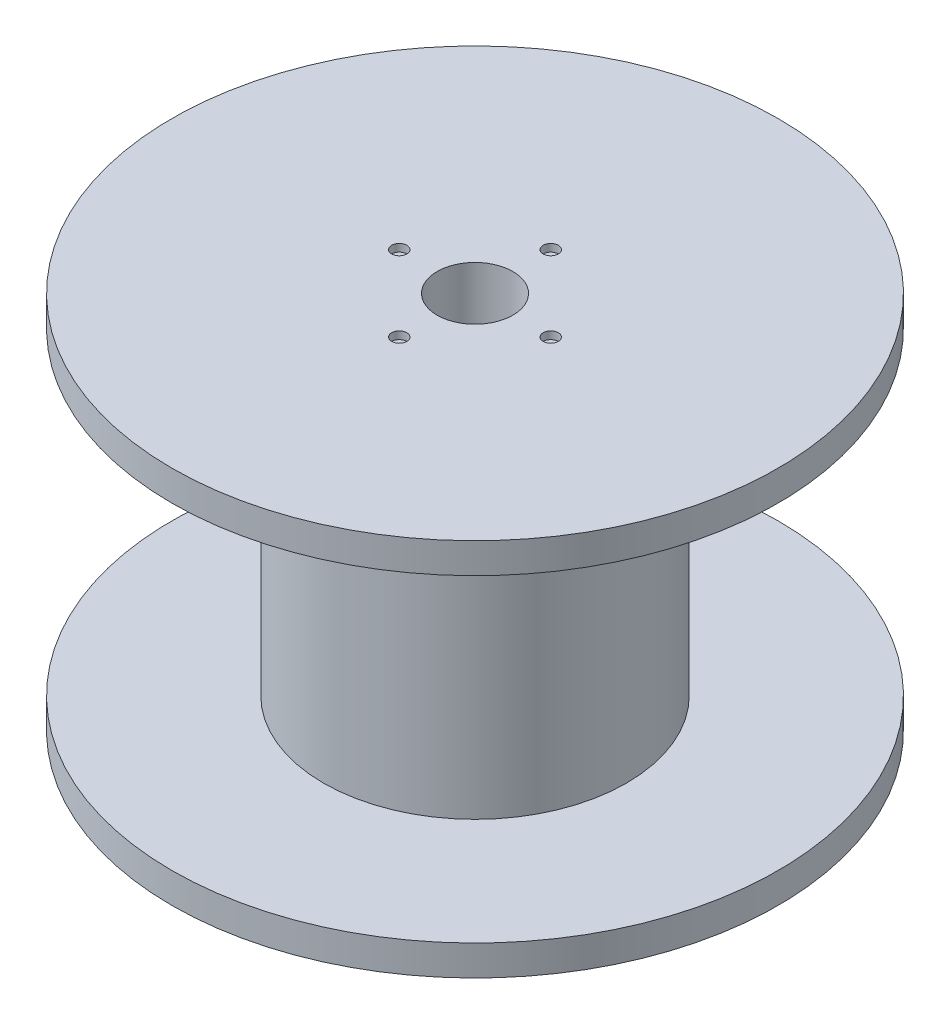
ISO-10303-21;
HEADER;
FILE_DESCRIPTION(('STEP AP214'),'2;1');
FILE_NAME('part.step','',(''),(''),'','','');
FILE_SCHEMA(('AUTOMOTIVE_DESIGN { 1 0 10303 214 1 1 1 1 }'));
ENDSEC;
DATA;
#1=APPLICATION_CONTEXT('core data for automotive mechanical design processes');
#2=APPLICATION_PROTOCOL_DEFINITION('international standard','automotive_design',2000,#1);
#3=PRODUCT_CONTEXT('',#1,'mechanical');
#4=PRODUCT('Part','Part','',(#3));
#5=PRODUCT_RELATED_PRODUCT_CATEGORY('part','',(#4));
#6=PRODUCT_DEFINITION_FORMATION('','',#4);
#7=PRODUCT_DEFINITION_CONTEXT('part definition',#1,'design');
#8=PRODUCT_DEFINITION('design','',#6,#7);
#9=PRODUCT_DEFINITION_SHAPE('','',#8);
#10=(LENGTH_UNIT() NAMED_UNIT(*) SI_UNIT(.MILLI.,.METRE.));
#11=(NAMED_UNIT(*) PLANE_ANGLE_UNIT() SI_UNIT($,.RADIAN.));
#12=(NAMED_UNIT(*) SI_UNIT($,.STERADIAN.) SOLID_ANGLE_UNIT());
#13=UNCERTAINTY_MEASURE_WITH_UNIT(LENGTH_MEASURE(1.E-05),#10,'distance_accuracy_value','');
#14=(GEOMETRIC_REPRESENTATION_CONTEXT(3) GLOBAL_UNCERTAINTY_ASSIGNED_CONTEXT((#13)) GLOBAL_UNIT_ASSIGNED_CONTEXT((#10,
#11,#12)) REPRESENTATION_CONTEXT('',''));
#15=CARTESIAN_POINT('',(0.,0.,0.));
#16=DIRECTION('',(0.,0.,1.));
#17=DIRECTION('',(1.,0.,0.));
#18=AXIS2_PLACEMENT_3D('',#15,#16,#17);
#19=CARTESIAN_POINT('',(0.,0.,0.));
#20=DIRECTION('',(0.,1.,0.));
#21=DIRECTION('',(0.,0.,1.));
#22=AXIS2_PLACEMENT_3D('',#19,#20,#21);
#23=PLANE('',#22);
#24=CARTESIAN_POINT('',(0.,0.,5.));
#25=DIRECTION('',(0.,1.,0.));
#26=DIRECTION('',(0.,0.,1.));
#27=AXIS2_PLACEMENT_3D('',#24,#25,#26);
#28=CIRCLE('',#27,0.5);
#29=CARTESIAN_POINT('',(0.,0.,5.5));
#30=VERTEX_POINT('',#29);
#31=EDGE_CURVE('E98',#30,#30,#28,.T.);
#32=ORIENTED_EDGE('',*,*,#31,.T.);
#33=EDGE_LOOP('',(#32));
#34=FACE_BOUND('',#33,.T.);
#35=CARTESIAN_POINT('',(0.,0.,-5.));
#36=DIRECTION('',(0.,1.,0.));
#37=DIRECTION('',(0.,0.,1.));
#38=AXIS2_PLACEMENT_3D('',#35,#36,#37);
#39=CIRCLE('',#38,0.5);
#40=CARTESIAN_POINT('',(0.,0.,-4.5));
#41=VERTEX_POINT('',#40);
#42=EDGE_CURVE('E86',#41,#41,#39,.T.);
#43=ORIENTED_EDGE('',*,*,#42,.T.);
#44=EDGE_LOOP('',(#43));
#45=FACE_BOUND('',#44,.T.);
#46=CARTESIAN_POINT('',(0.,0.,0.));
#47=DIRECTION('',(0.,1.,0.));
#48=DIRECTION('',(0.,0.,1.));
#49=AXIS2_PLACEMENT_3D('',#46,#47,#48);
#50=CIRCLE('',#49,2.5);
#51=CARTESIAN_POINT('',(0.,0.,2.5));
#52=VERTEX_POINT('',#51);
#53=EDGE_CURVE('E53',#52,#52,#50,.T.);
#54=ORIENTED_EDGE('',*,*,#53,.T.);
#55=EDGE_LOOP('',(#54));
#56=FACE_BOUND('',#55,.T.);
#57=CARTESIAN_POINT('',(0.,0.,0.));
#58=DIRECTION('',(0.,1.,0.));
#59=DIRECTION('',(0.,0.,1.));
#60=AXIS2_PLACEMENT_3D('',#57,#58,#59);
#61=CIRCLE('',#60,20.);
#62=CARTESIAN_POINT('',(0.,0.,20.));
#63=VERTEX_POINT('',#62);
#64=EDGE_CURVE('E49',#63,#63,#61,.T.);
#65=ORIENTED_EDGE('',*,*,#64,.F.);
#66=EDGE_LOOP('',(#65));
#67=FACE_BOUND('',#66,.T.);
#68=CARTESIAN_POINT('',(5.,0.,0.));
#69=DIRECTION('',(0.,1.,0.));
#70=DIRECTION('',(0.,0.,1.));
#71=AXIS2_PLACEMENT_3D('',#68,#69,#70);
#72=CIRCLE('',#71,0.500000000000001);
#73=CARTESIAN_POINT('',(5.,0.,0.500000000000001));
#74=VERTEX_POINT('',#73);
#75=EDGE_CURVE('E92',#74,#74,#72,.T.);
#76=ORIENTED_EDGE('',*,*,#75,.T.);
#77=EDGE_LOOP('',(#76));
#78=FACE_BOUND('',#77,.T.);
#79=CARTESIAN_POINT('',(-5.,0.,0.));
#80=DIRECTION('',(0.,1.,0.));
#81=DIRECTION('',(0.,0.,1.));
#82=AXIS2_PLACEMENT_3D('',#79,#80,#81);
#83=CIRCLE('',#82,0.500000000000001);
#84=CARTESIAN_POINT('',(-5.,0.,0.500000000000001));
#85=VERTEX_POINT('',#84);
#86=EDGE_CURVE('E104',#85,#85,#83,.T.);
#87=ORIENTED_EDGE('',*,*,#86,.T.);
#88=EDGE_LOOP('',(#87));
#89=FACE_BOUND('',#88,.T.);
#90=ADVANCED_FACE('F32',(#34,#45,#56,#67,#78,#89),#23,.F.);
#91=CARTESIAN_POINT('',(0.,25.,0.));
#92=DIRECTION('',(0.,-1.,0.));
#93=DIRECTION('',(0.,0.,-1.));
#94=AXIS2_PLACEMENT_3D('',#91,#92,#93);
#95=CYLINDRICAL_SURFACE('',#94,10.);
#96=CARTESIAN_POINT('',(0.,2.,0.));
#97=DIRECTION('',(0.,1.,0.));
#98=DIRECTION('',(0.,0.,1.));
#99=AXIS2_PLACEMENT_3D('',#96,#97,#98);
#100=CIRCLE('',#99,10.);
#101=CARTESIAN_POINT('',(0.,2.,10.));
#102=VERTEX_POINT('',#101);
#103=EDGE_CURVE('E36',#102,#102,#100,.T.);
#104=ORIENTED_EDGE('',*,*,#103,.T.);
#105=EDGE_LOOP('',(#104));
#106=FACE_BOUND('',#105,.T.);
#107=CARTESIAN_POINT('',(0.,23.,0.));
#108=DIRECTION('',(0.,1.,0.));
#109=DIRECTION('',(0.,0.,1.));
#110=AXIS2_PLACEMENT_3D('',#107,#108,#109);
#111=CIRCLE('',#110,10.);
#112=CARTESIAN_POINT('',(0.,23.,10.));
#113=VERTEX_POINT('',#112);
#114=EDGE_CURVE('E10',#113,#113,#111,.T.);
#115=ORIENTED_EDGE('',*,*,#114,.F.);
#116=EDGE_LOOP('',(#115));
#117=FACE_BOUND('',#116,.T.);
#118=ADVANCED_FACE('F34',(#106,#117),#95,.T.);
#119=CARTESIAN_POINT('',(0.,23.,0.));
#120=DIRECTION('',(0.,1.,0.));
#121=DIRECTION('',(0.,0.,1.));
#122=AXIS2_PLACEMENT_3D('',#119,#120,#121);
#123=PLANE('',#122);
#124=CARTESIAN_POINT('',(0.,23.,0.));
#125=DIRECTION('',(0.,1.,0.));
#126=DIRECTION('',(0.,0.,1.));
#127=AXIS2_PLACEMENT_3D('',#124,#125,#126);
#128=CIRCLE('',#127,20.);
#129=CARTESIAN_POINT('',(0.,23.,20.));
#130=VERTEX_POINT('',#129);
#131=EDGE_CURVE('E40',#130,#130,#128,.T.);
#132=ORIENTED_EDGE('',*,*,#131,.F.);
#133=EDGE_LOOP('',(#132));
#134=FACE_BOUND('',#133,.T.);
#135=ORIENTED_EDGE('',*,*,#114,.T.);
#136=EDGE_LOOP('',(#135));
#137=FACE_BOUND('',#136,.T.);
#138=ADVANCED_FACE('F126',(#134,#137),#123,.F.);
#139=CARTESIAN_POINT('',(0.,23.,0.));
#140=DIRECTION('',(0.,1.,0.));
#141=DIRECTION('',(0.,0.,1.));
#142=AXIS2_PLACEMENT_3D('',#139,#140,#141);
#143=CYLINDRICAL_SURFACE('',#142,20.);
#144=ORIENTED_EDGE('',*,*,#131,.T.);
#145=EDGE_LOOP('',(#144));
#146=FACE_BOUND('',#145,.T.);
#147=CARTESIAN_POINT('',(0.,25.,0.));
#148=DIRECTION('',(0.,1.,0.));
#149=DIRECTION('',(0.,0.,1.));
#150=AXIS2_PLACEMENT_3D('',#147,#148,#149);
#151=CIRCLE('',#150,20.);
#152=CARTESIAN_POINT('',(0.,25.,20.));
#153=VERTEX_POINT('',#152);
#154=EDGE_CURVE('E44',#153,#153,#151,.T.);
#155=ORIENTED_EDGE('',*,*,#154,.F.);
#156=EDGE_LOOP('',(#155));
#157=FACE_BOUND('',#156,.T.);
#158=ADVANCED_FACE('F134',(#146,#157),#143,.T.);
#159=CARTESIAN_POINT('',(0.,25.,0.));
#160=DIRECTION('',(0.,1.,0.));
#161=DIRECTION('',(0.,0.,1.));
#162=AXIS2_PLACEMENT_3D('',#159,#160,#161);
#163=PLANE('',#162);
#164=CARTESIAN_POINT('',(-5.,25.,0.));
#165=DIRECTION('',(0.,1.,0.));
#166=DIRECTION('',(0.,0.,1.));
#167=AXIS2_PLACEMENT_3D('',#164,#165,#166);
#168=CIRCLE('',#167,0.500000000000001);
#169=CARTESIAN_POINT('',(-5.,25.,0.500000000000001));
#170=VERTEX_POINT('',#169);
#171=EDGE_CURVE('E80',#170,#170,#168,.T.);
#172=ORIENTED_EDGE('',*,*,#171,.F.);
#173=EDGE_LOOP('',(#172));
#174=FACE_BOUND('',#173,.T.);
#175=CARTESIAN_POINT('',(0.,25.,5.));
#176=DIRECTION('',(0.,1.,0.));
#177=DIRECTION('',(0.,0.,1.));
#178=AXIS2_PLACEMENT_3D('',#175,#176,#177);
#179=CIRCLE('',#178,0.5);
#180=CARTESIAN_POINT('',(0.,25.,5.5));
#181=VERTEX_POINT('',#180);
#182=EDGE_CURVE('E74',#181,#181,#179,.T.);
#183=ORIENTED_EDGE('',*,*,#182,.F.);
#184=EDGE_LOOP('',(#183));
#185=FACE_BOUND('',#184,.T.);
#186=CARTESIAN_POINT('',(5.,25.,0.));
#187=DIRECTION('',(0.,1.,0.));
#188=DIRECTION('',(0.,0.,1.));
#189=AXIS2_PLACEMENT_3D('',#186,#187,#188);
#190=CIRCLE('',#189,0.500000000000001);
#191=CARTESIAN_POINT('',(5.,25.,0.500000000000001));
#192=VERTEX_POINT('',#191);
#193=EDGE_CURVE('E68',#192,#192,#190,.T.);
#194=ORIENTED_EDGE('',*,*,#193,.F.);
#195=EDGE_LOOP('',(#194));
#196=FACE_BOUND('',#195,.T.);
#197=CARTESIAN_POINT('',(0.,25.,-5.));
#198=DIRECTION('',(0.,1.,0.));
#199=DIRECTION('',(0.,0.,1.));
#200=AXIS2_PLACEMENT_3D('',#197,#198,#199);
#201=CIRCLE('',#200,0.5);
#202=CARTESIAN_POINT('',(0.,25.,-4.5));
#203=VERTEX_POINT('',#202);
#204=EDGE_CURVE('E62',#203,#203,#201,.T.);
#205=ORIENTED_EDGE('',*,*,#204,.F.);
#206=EDGE_LOOP('',(#205));
#207=FACE_BOUND('',#206,.T.);
#208=CARTESIAN_POINT('',(0.,25.,0.));
#209=DIRECTION('',(0.,1.,0.));
#210=DIRECTION('',(0.,0.,1.));
#211=AXIS2_PLACEMENT_3D('',#208,#209,#210);
#212=CIRCLE('',#211,2.5);
#213=CARTESIAN_POINT('',(0.,25.,2.5));
#214=VERTEX_POINT('',#213);
#215=EDGE_CURVE('E56',#214,#214,#212,.T.);
#216=ORIENTED_EDGE('',*,*,#215,.F.);
#217=EDGE_LOOP('',(#216));
#218=FACE_BOUND('',#217,.T.);
#219=ORIENTED_EDGE('',*,*,#154,.T.);
#220=EDGE_LOOP('',(#219));
#221=FACE_BOUND('',#220,.T.);
#222=ADVANCED_FACE('F130',(#174,#185,#196,#207,#218,#221),#163,.T.);
#223=CARTESIAN_POINT('',(0.,2.,0.));
#224=DIRECTION('',(0.,1.,0.));
#225=DIRECTION('',(0.,0.,1.));
#226=AXIS2_PLACEMENT_3D('',#223,#224,#225);
#227=PLANE('',#226);
#228=CARTESIAN_POINT('',(0.,2.,0.));
#229=DIRECTION('',(0.,1.,0.));
#230=DIRECTION('',(0.,0.,1.));
#231=AXIS2_PLACEMENT_3D('',#228,#229,#230);
#232=CIRCLE('',#231,20.);
#233=CARTESIAN_POINT('',(0.,2.,20.));
#234=VERTEX_POINT('',#233);
#235=EDGE_CURVE('E52',#234,#234,#232,.T.);
#236=ORIENTED_EDGE('',*,*,#235,.T.);
#237=EDGE_LOOP('',(#236));
#238=FACE_BOUND('',#237,.T.);
#239=ORIENTED_EDGE('',*,*,#103,.F.);
#240=EDGE_LOOP('',(#239));
#241=FACE_BOUND('',#240,.T.);
#242=ADVANCED_FACE('F133',(#238,#241),#227,.T.);
#243=CARTESIAN_POINT('',(0.,2.,0.));
#244=DIRECTION('',(0.,-1.,0.));
#245=DIRECTION('',(0.,0.,-1.));
#246=AXIS2_PLACEMENT_3D('',#243,#244,#245);
#247=CYLINDRICAL_SURFACE('',#246,20.);
#248=ORIENTED_EDGE('',*,*,#235,.F.);
#249=EDGE_LOOP('',(#248));
#250=FACE_BOUND('',#249,.T.);
#251=ORIENTED_EDGE('',*,*,#64,.T.);
#252=EDGE_LOOP('',(#251));
#253=FACE_BOUND('',#252,.T.);
#254=ADVANCED_FACE('F142',(#250,#253),#247,.T.);
#255=CARTESIAN_POINT('',(0.,0.,0.));
#256=DIRECTION('',(0.,1.,0.));
#257=DIRECTION('',(0.,0.,1.));
#258=AXIS2_PLACEMENT_3D('',#255,#256,#257);
#259=CYLINDRICAL_SURFACE('',#258,2.5);
#260=ORIENTED_EDGE('',*,*,#53,.F.);
#261=EDGE_LOOP('',(#260));
#262=FACE_BOUND('',#261,.T.);
#263=ORIENTED_EDGE('',*,*,#215,.T.);
#264=EDGE_LOOP('',(#263));
#265=FACE_BOUND('',#264,.T.);
#266=ADVANCED_FACE('F145',(#262,#265),#259,.F.);
#267=CARTESIAN_POINT('',(0.,24.5,-5.));
#268=DIRECTION('',(0.,1.,0.));
#269=DIRECTION('',(0.,0.,1.));
#270=AXIS2_PLACEMENT_3D('',#267,#268,#269);
#271=CYLINDRICAL_SURFACE('',#270,0.5);
#272=CARTESIAN_POINT('',(0.,24.5,-5.));
#273=DIRECTION('',(0.,1.,0.));
#274=DIRECTION('',(0.,0.,1.));
#275=AXIS2_PLACEMENT_3D('',#272,#273,#274);
#276=CIRCLE('',#275,0.5);
#277=CARTESIAN_POINT('',(0.,24.5,-4.5));
#278=VERTEX_POINT('',#277);
#279=EDGE_CURVE('E59',#278,#278,#276,.T.);
#280=ORIENTED_EDGE('',*,*,#279,.F.);
#281=EDGE_LOOP('',(#280));
#282=FACE_BOUND('',#281,.T.);
#283=ORIENTED_EDGE('',*,*,#204,.T.);
#284=EDGE_LOOP('',(#283));
#285=FACE_BOUND('',#284,.T.);
#286=ADVANCED_FACE('F152',(#282,#285),#271,.F.);
#287=CARTESIAN_POINT('',(0.,24.5,-5.));
#288=DIRECTION('',(0.,1.,0.));
#289=DIRECTION('',(0.,0.,1.));
#290=AXIS2_PLACEMENT_3D('',#287,#288,#289);
#291=PLANE('',#290);
#292=ORIENTED_EDGE('',*,*,#279,.T.);
#293=EDGE_LOOP('',(#292));
#294=FACE_BOUND('',#293,.T.);
#295=ADVANCED_FACE('F156',(#294),#291,.T.);
#296=CARTESIAN_POINT('',(5.,24.5,0.));
#297=DIRECTION('',(0.,1.,0.));
#298=DIRECTION('',(0.,0.,1.));
#299=AXIS2_PLACEMENT_3D('',#296,#297,#298);
#300=CYLINDRICAL_SURFACE('',#299,0.500000000000001);
#301=CARTESIAN_POINT('',(5.,24.5,0.));
#302=DIRECTION('',(0.,1.,0.));
#303=DIRECTION('',(0.,0.,1.));
#304=AXIS2_PLACEMENT_3D('',#301,#302,#303);
#305=CIRCLE('',#304,0.500000000000001);
#306=CARTESIAN_POINT('',(5.,24.5,0.500000000000001));
#307=VERTEX_POINT('',#306);
#308=EDGE_CURVE('E65',#307,#307,#305,.T.);
#309=ORIENTED_EDGE('',*,*,#308,.F.);
#310=EDGE_LOOP('',(#309));
#311=FACE_BOUND('',#310,.T.);
#312=ORIENTED_EDGE('',*,*,#193,.T.);
#313=EDGE_LOOP('',(#312));
#314=FACE_BOUND('',#313,.T.);
#315=ADVANCED_FACE('F160',(#311,#314),#300,.F.);
#316=CARTESIAN_POINT('',(5.,24.5,0.));
#317=DIRECTION('',(0.,1.,0.));
#318=DIRECTION('',(0.,0.,1.));
#319=AXIS2_PLACEMENT_3D('',#316,#317,#318);
#320=PLANE('',#319);
#321=ORIENTED_EDGE('',*,*,#308,.T.);
#322=EDGE_LOOP('',(#321));
#323=FACE_BOUND('',#322,.T.);
#324=ADVANCED_FACE('F164',(#323),#320,.T.);
#325=CARTESIAN_POINT('',(0.,24.5,5.));
#326=DIRECTION('',(0.,1.,0.));
#327=DIRECTION('',(0.,0.,1.));
#328=AXIS2_PLACEMENT_3D('',#325,#326,#327);
#329=CYLINDRICAL_SURFACE('',#328,0.5);
#330=CARTESIAN_POINT('',(0.,24.5,5.));
#331=DIRECTION('',(0.,1.,0.));
#332=DIRECTION('',(0.,0.,1.));
#333=AXIS2_PLACEMENT_3D('',#330,#331,#332);
#334=CIRCLE('',#333,0.5);
#335=CARTESIAN_POINT('',(0.,24.5,5.5));
#336=VERTEX_POINT('',#335);
#337=EDGE_CURVE('E71',#336,#336,#334,.T.);
#338=ORIENTED_EDGE('',*,*,#337,.F.);
#339=EDGE_LOOP('',(#338));
#340=FACE_BOUND('',#339,.T.);
#341=ORIENTED_EDGE('',*,*,#182,.T.);
#342=EDGE_LOOP('',(#341));
#343=FACE_BOUND('',#342,.T.);
#344=ADVANCED_FACE('F168',(#340,#343),#329,.F.);
#345=CARTESIAN_POINT('',(0.,24.5,5.));
#346=DIRECTION('',(0.,1.,0.));
#347=DIRECTION('',(0.,0.,1.));
#348=AXIS2_PLACEMENT_3D('',#345,#346,#347);
#349=PLANE('',#348);
#350=ORIENTED_EDGE('',*,*,#337,.T.);
#351=EDGE_LOOP('',(#350));
#352=FACE_BOUND('',#351,.T.);
#353=ADVANCED_FACE('F172',(#352),#349,.T.);
#354=CARTESIAN_POINT('',(-5.,24.5,0.));
#355=DIRECTION('',(0.,1.,0.));
#356=DIRECTION('',(0.,0.,1.));
#357=AXIS2_PLACEMENT_3D('',#354,#355,#356);
#358=CYLINDRICAL_SURFACE('',#357,0.500000000000001);
#359=CARTESIAN_POINT('',(-5.,24.5,0.));
#360=DIRECTION('',(0.,1.,0.));
#361=DIRECTION('',(0.,0.,1.));
#362=AXIS2_PLACEMENT_3D('',#359,#360,#361);
#363=CIRCLE('',#362,0.500000000000001);
#364=CARTESIAN_POINT('',(-5.,24.5,0.500000000000001));
#365=VERTEX_POINT('',#364);
#366=EDGE_CURVE('E77',#365,#365,#363,.T.);
#367=ORIENTED_EDGE('',*,*,#366,.F.);
#368=EDGE_LOOP('',(#367));
#369=FACE_BOUND('',#368,.T.);
#370=ORIENTED_EDGE('',*,*,#171,.T.);
#371=EDGE_LOOP('',(#370));
#372=FACE_BOUND('',#371,.T.);
#373=ADVANCED_FACE('F176',(#369,#372),#358,.F.);
#374=CARTESIAN_POINT('',(-5.,24.5,0.));
#375=DIRECTION('',(0.,1.,0.));
#376=DIRECTION('',(0.,0.,1.));
#377=AXIS2_PLACEMENT_3D('',#374,#375,#376);
#378=PLANE('',#377);
#379=ORIENTED_EDGE('',*,*,#366,.T.);
#380=EDGE_LOOP('',(#379));
#381=FACE_BOUND('',#380,.T.);
#382=ADVANCED_FACE('F180',(#381),#378,.T.);
#383=CARTESIAN_POINT('',(0.,0.5,-5.));
#384=DIRECTION('',(0.,-1.,0.));
#385=DIRECTION('',(0.,0.,-1.));
#386=AXIS2_PLACEMENT_3D('',#383,#384,#385);
#387=CYLINDRICAL_SURFACE('',#386,0.5);
#388=CARTESIAN_POINT('',(0.,0.5,-5.));
#389=DIRECTION('',(0.,1.,0.));
#390=DIRECTION('',(0.,0.,1.));
#391=AXIS2_PLACEMENT_3D('',#388,#389,#390);
#392=CIRCLE('',#391,0.5);
#393=CARTESIAN_POINT('',(0.,0.5,-4.5));
#394=VERTEX_POINT('',#393);
#395=EDGE_CURVE('E83',#394,#394,#392,.T.);
#396=ORIENTED_EDGE('',*,*,#395,.T.);
#397=EDGE_LOOP('',(#396));
#398=FACE_BOUND('',#397,.T.);
#399=ORIENTED_EDGE('',*,*,#42,.F.);
#400=EDGE_LOOP('',(#399));
#401=FACE_BOUND('',#400,.T.);
#402=ADVANCED_FACE('F184',(#398,#401),#387,.F.);
#403=CARTESIAN_POINT('',(0.,0.5,-5.));
#404=DIRECTION('',(0.,1.,0.));
#405=DIRECTION('',(0.,0.,1.));
#406=AXIS2_PLACEMENT_3D('',#403,#404,#405);
#407=PLANE('',#406);
#408=ORIENTED_EDGE('',*,*,#395,.F.);
#409=EDGE_LOOP('',(#408));
#410=FACE_BOUND('',#409,.T.);
#411=ADVANCED_FACE('F188',(#410),#407,.F.);
#412=CARTESIAN_POINT('',(5.,0.5,0.));
#413=DIRECTION('',(0.,-1.,0.));
#414=DIRECTION('',(0.,0.,-1.));
#415=AXIS2_PLACEMENT_3D('',#412,#413,#414);
#416=CYLINDRICAL_SURFACE('',#415,0.500000000000001);
#417=CARTESIAN_POINT('',(5.,0.5,0.));
#418=DIRECTION('',(0.,1.,0.));
#419=DIRECTION('',(0.,0.,1.));
#420=AXIS2_PLACEMENT_3D('',#417,#418,#419);
#421=CIRCLE('',#420,0.500000000000001);
#422=CARTESIAN_POINT('',(5.,0.5,0.500000000000001));
#423=VERTEX_POINT('',#422);
#424=EDGE_CURVE('E89',#423,#423,#421,.T.);
#425=ORIENTED_EDGE('',*,*,#424,.T.);
#426=EDGE_LOOP('',(#425));
#427=FACE_BOUND('',#426,.T.);
#428=ORIENTED_EDGE('',*,*,#75,.F.);
#429=EDGE_LOOP('',(#428));
#430=FACE_BOUND('',#429,.T.);
#431=ADVANCED_FACE('F192',(#427,#430),#416,.F.);
#432=CARTESIAN_POINT('',(5.,0.5,0.));
#433=DIRECTION('',(0.,1.,0.));
#434=DIRECTION('',(0.,0.,1.));
#435=AXIS2_PLACEMENT_3D('',#432,#433,#434);
#436=PLANE('',#435);
#437=ORIENTED_EDGE('',*,*,#424,.F.);
#438=EDGE_LOOP('',(#437));
#439=FACE_BOUND('',#438,.T.);
#440=ADVANCED_FACE('F196',(#439),#436,.F.);
#441=CARTESIAN_POINT('',(0.,0.5,5.));
#442=DIRECTION('',(0.,-1.,0.));
#443=DIRECTION('',(0.,0.,-1.));
#444=AXIS2_PLACEMENT_3D('',#441,#442,#443);
#445=CYLINDRICAL_SURFACE('',#444,0.5);
#446=CARTESIAN_POINT('',(0.,0.5,5.));
#447=DIRECTION('',(0.,1.,0.));
#448=DIRECTION('',(0.,0.,1.));
#449=AXIS2_PLACEMENT_3D('',#446,#447,#448);
#450=CIRCLE('',#449,0.5);
#451=CARTESIAN_POINT('',(0.,0.5,5.5));
#452=VERTEX_POINT('',#451);
#453=EDGE_CURVE('E95',#452,#452,#450,.T.);
#454=ORIENTED_EDGE('',*,*,#453,.T.);
#455=EDGE_LOOP('',(#454));
#456=FACE_BOUND('',#455,.T.);
#457=ORIENTED_EDGE('',*,*,#31,.F.);
#458=EDGE_LOOP('',(#457));
#459=FACE_BOUND('',#458,.T.);
#460=ADVANCED_FACE('F200',(#456,#459),#445,.F.);
#461=CARTESIAN_POINT('',(0.,0.5,5.));
#462=DIRECTION('',(0.,1.,0.));
#463=DIRECTION('',(0.,0.,1.));
#464=AXIS2_PLACEMENT_3D('',#461,#462,#463);
#465=PLANE('',#464);
#466=ORIENTED_EDGE('',*,*,#453,.F.);
#467=EDGE_LOOP('',(#466));
#468=FACE_BOUND('',#467,.T.);
#469=ADVANCED_FACE('F119',(#468),#465,.F.);
#470=CARTESIAN_POINT('',(-5.,0.5,0.));
#471=DIRECTION('',(0.,-1.,0.));
#472=DIRECTION('',(0.,0.,-1.));
#473=AXIS2_PLACEMENT_3D('',#470,#471,#472);
#474=CYLINDRICAL_SURFACE('',#473,0.500000000000001);
#475=CARTESIAN_POINT('',(-5.,0.5,0.));
#476=DIRECTION('',(0.,1.,0.));
#477=DIRECTION('',(0.,0.,1.));
#478=AXIS2_PLACEMENT_3D('',#475,#476,#477);
#479=CIRCLE('',#478,0.500000000000001);
#480=CARTESIAN_POINT('',(-5.,0.5,0.500000000000001));
#481=VERTEX_POINT('',#480);
#482=EDGE_CURVE('E101',#481,#481,#479,.T.);
#483=ORIENTED_EDGE('',*,*,#482,.T.);
#484=EDGE_LOOP('',(#483));
#485=FACE_BOUND('',#484,.T.);
#486=ORIENTED_EDGE('',*,*,#86,.F.);
#487=EDGE_LOOP('',(#486));
#488=FACE_BOUND('',#487,.T.);
#489=ADVANCED_FACE('F110',(#485,#488),#474,.F.);
#490=CARTESIAN_POINT('',(-5.,0.5,0.));
#491=DIRECTION('',(0.,1.,0.));
#492=DIRECTION('',(0.,0.,1.));
#493=AXIS2_PLACEMENT_3D('',#490,#491,#492);
#494=PLANE('',#493);
#495=ORIENTED_EDGE('',*,*,#482,.F.);
#496=EDGE_LOOP('',(#495));
#497=FACE_BOUND('',#496,.T.);
#498=ADVANCED_FACE('F113',(#497),#494,.F.);
#499=CLOSED_SHELL('',(#90,#118,#138,#158,#222,#242,#254,#266,#286,#295,#315,#324,#344,#353,#373,
#382,#402,#411,#431,#440,#460,#469,#489,#498));
#500=MANIFOLD_SOLID_BREP('B2',#499);
#501=ADVANCED_BREP_SHAPE_REPRESENTATION('',(#18,#500),#14);
#502=SHAPE_DEFINITION_REPRESENTATION(#9,#501);
ENDSEC;
END-ISO-10303-21;
